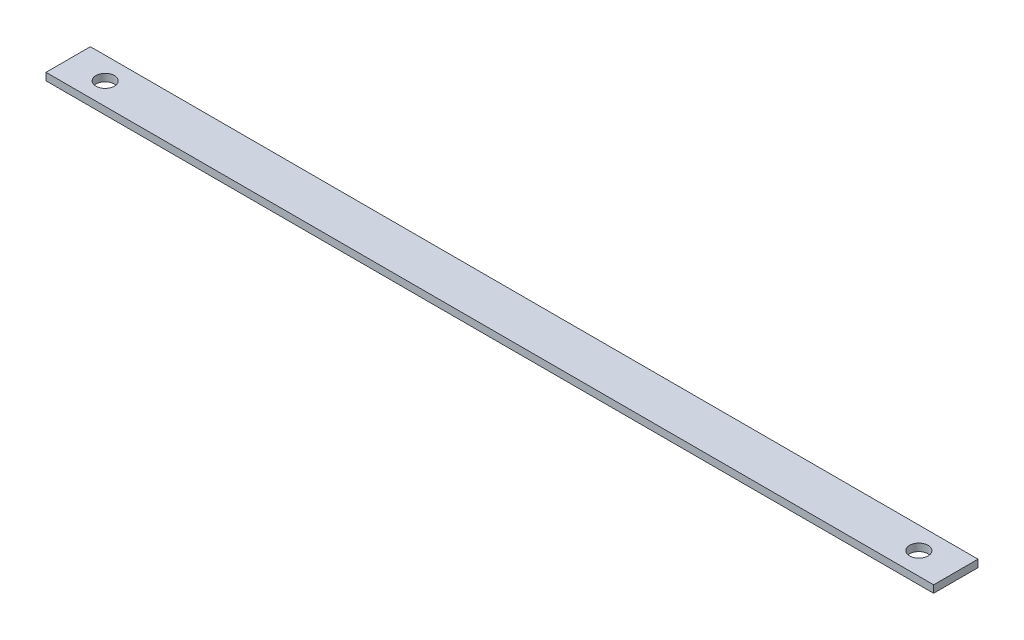
ISO-10303-21;
HEADER;
FILE_DESCRIPTION(('STEP AP214'),'2;1');
FILE_NAME('part.step','',(''),(''),'','','');
FILE_SCHEMA(('AUTOMOTIVE_DESIGN { 1 0 10303 214 1 1 1 1 }'));
ENDSEC;
DATA;
#1=APPLICATION_CONTEXT('core data for automotive mechanical design processes');
#2=APPLICATION_PROTOCOL_DEFINITION('international standard','automotive_design',2000,#1);
#3=PRODUCT_CONTEXT('',#1,'mechanical');
#4=PRODUCT('Part','Part','',(#3));
#5=PRODUCT_RELATED_PRODUCT_CATEGORY('part','',(#4));
#6=PRODUCT_DEFINITION_FORMATION('','',#4);
#7=PRODUCT_DEFINITION_CONTEXT('part definition',#1,'design');
#8=PRODUCT_DEFINITION('design','',#6,#7);
#9=PRODUCT_DEFINITION_SHAPE('','',#8);
#10=(LENGTH_UNIT() NAMED_UNIT(*) SI_UNIT(.MILLI.,.METRE.));
#11=(NAMED_UNIT(*) PLANE_ANGLE_UNIT() SI_UNIT($,.RADIAN.));
#12=(NAMED_UNIT(*) SI_UNIT($,.STERADIAN.) SOLID_ANGLE_UNIT());
#13=UNCERTAINTY_MEASURE_WITH_UNIT(LENGTH_MEASURE(1.E-05),#10,'distance_accuracy_value','');
#14=(GEOMETRIC_REPRESENTATION_CONTEXT(3) GLOBAL_UNCERTAINTY_ASSIGNED_CONTEXT((#13)) GLOBAL_UNIT_ASSIGNED_CONTEXT((#10,
#11,#12)) REPRESENTATION_CONTEXT('',''));
#15=CARTESIAN_POINT('',(0.,0.,0.));
#16=DIRECTION('',(0.,0.,1.));
#17=DIRECTION('',(1.,0.,0.));
#18=AXIS2_PLACEMENT_3D('',#15,#16,#17);
#19=CARTESIAN_POINT('',(0.,2.,0.));
#20=DIRECTION('',(0.,-1.,0.));
#21=DIRECTION('',(0.,0.,-1.));
#22=AXIS2_PLACEMENT_3D('',#19,#20,#21);
#23=PLANE('',#22);
#24=DIRECTION('',(0.,0.,-1.));
#25=VECTOR('',#24,1.);
#26=CARTESIAN_POINT('',(120.,2.,6.));
#27=LINE('',#26,#25);
#28=CARTESIAN_POINT('',(120.,2.,6.));
#29=VERTEX_POINT('',#28);
#30=CARTESIAN_POINT('',(120.,2.,-6.));
#31=VERTEX_POINT('',#30);
#32=EDGE_CURVE('E87',#29,#31,#27,.T.);
#33=ORIENTED_EDGE('',*,*,#32,.T.);
#34=DIRECTION('',(-1.,0.,0.));
#35=VECTOR('',#34,1.);
#36=CARTESIAN_POINT('',(-120.,2.,-6.));
#37=LINE('',#36,#35);
#38=CARTESIAN_POINT('',(-120.,2.,-6.));
#39=VERTEX_POINT('',#38);
#40=EDGE_CURVE('E82',#31,#39,#37,.T.);
#41=ORIENTED_EDGE('',*,*,#40,.T.);
#42=DIRECTION('',(0.,0.,1.));
#43=VECTOR('',#42,1.);
#44=CARTESIAN_POINT('',(-120.,2.,6.));
#45=LINE('',#44,#43);
#46=CARTESIAN_POINT('',(-120.,2.,6.));
#47=VERTEX_POINT('',#46);
#48=EDGE_CURVE('E85',#39,#47,#45,.T.);
#49=ORIENTED_EDGE('',*,*,#48,.T.);
#50=DIRECTION('',(1.,0.,0.));
#51=VECTOR('',#50,1.);
#52=CARTESIAN_POINT('',(-120.,2.,6.));
#53=LINE('',#52,#51);
#54=EDGE_CURVE('E52',#47,#29,#53,.T.);
#55=ORIENTED_EDGE('',*,*,#54,.T.);
#56=EDGE_LOOP('',(#33,#41,#49,#55));
#57=FACE_BOUND('',#56,.T.);
#58=CARTESIAN_POINT('',(110.,2.,0.));
#59=DIRECTION('',(0.,1.,0.));
#60=DIRECTION('',(0.,0.,1.));
#61=AXIS2_PLACEMENT_3D('',#58,#59,#60);
#62=CIRCLE('',#61,2.5);
#63=CARTESIAN_POINT('',(110.,2.,2.5));
#64=VERTEX_POINT('',#63);
#65=EDGE_CURVE('E115',#64,#64,#62,.T.);
#66=ORIENTED_EDGE('',*,*,#65,.F.);
#67=EDGE_LOOP('',(#66));
#68=FACE_BOUND('',#67,.T.);
#69=CARTESIAN_POINT('',(-110.,2.,0.));
#70=DIRECTION('',(0.,1.,0.));
#71=DIRECTION('',(0.,0.,1.));
#72=AXIS2_PLACEMENT_3D('',#69,#70,#71);
#73=CIRCLE('',#72,2.5);
#74=CARTESIAN_POINT('',(-110.,2.,2.50000000000003));
#75=VERTEX_POINT('',#74);
#76=EDGE_CURVE('E121',#75,#75,#73,.T.);
#77=ORIENTED_EDGE('',*,*,#76,.F.);
#78=EDGE_LOOP('',(#77));
#79=FACE_BOUND('',#78,.T.);
#80=ADVANCED_FACE('F35',(#57,#68,#79),#23,.F.);
#81=CARTESIAN_POINT('',(120.,2.,6.));
#82=DIRECTION('',(-1.,0.,0.));
#83=DIRECTION('',(0.,0.,1.));
#84=AXIS2_PLACEMENT_3D('',#81,#82,#83);
#85=PLANE('',#84);
#86=DIRECTION('',(0.,0.,-1.));
#87=VECTOR('',#86,1.);
#88=CARTESIAN_POINT('',(120.,0.,6.));
#89=LINE('',#88,#87);
#90=CARTESIAN_POINT('',(120.,0.,6.));
#91=VERTEX_POINT('',#90);
#92=CARTESIAN_POINT('',(120.,0.,-6.));
#93=VERTEX_POINT('',#92);
#94=EDGE_CURVE('E99',#91,#93,#89,.T.);
#95=ORIENTED_EDGE('',*,*,#94,.T.);
#96=DIRECTION('',(0.,-1.,0.));
#97=VECTOR('',#96,1.);
#98=CARTESIAN_POINT('',(120.,2.,-6.));
#99=LINE('',#98,#97);
#100=EDGE_CURVE('E11',#31,#93,#99,.T.);
#101=ORIENTED_EDGE('',*,*,#100,.F.);
#102=ORIENTED_EDGE('',*,*,#32,.F.);
#103=DIRECTION('',(0.,-1.,0.));
#104=VECTOR('',#103,1.);
#105=CARTESIAN_POINT('',(120.,2.,6.));
#106=LINE('',#105,#104);
#107=EDGE_CURVE('E95',#29,#91,#106,.T.);
#108=ORIENTED_EDGE('',*,*,#107,.T.);
#109=EDGE_LOOP('',(#95,#101,#102,#108));
#110=FACE_BOUND('',#109,.T.);
#111=ADVANCED_FACE('F37',(#110),#85,.F.);
#112=CARTESIAN_POINT('',(-120.,2.,-6.));
#113=DIRECTION('',(0.,0.,1.));
#114=DIRECTION('',(1.,0.,0.));
#115=AXIS2_PLACEMENT_3D('',#112,#113,#114);
#116=PLANE('',#115);
#117=DIRECTION('',(-1.,0.,0.));
#118=VECTOR('',#117,1.);
#119=CARTESIAN_POINT('',(-120.,0.,-6.));
#120=LINE('',#119,#118);
#121=CARTESIAN_POINT('',(-120.,0.,-6.));
#122=VERTEX_POINT('',#121);
#123=EDGE_CURVE('E91',#93,#122,#120,.T.);
#124=ORIENTED_EDGE('',*,*,#123,.T.);
#125=DIRECTION('',(0.,-1.,0.));
#126=VECTOR('',#125,1.);
#127=CARTESIAN_POINT('',(-120.,2.,-6.));
#128=LINE('',#127,#126);
#129=EDGE_CURVE('E44',#39,#122,#128,.T.);
#130=ORIENTED_EDGE('',*,*,#129,.F.);
#131=ORIENTED_EDGE('',*,*,#40,.F.);
#132=ORIENTED_EDGE('',*,*,#100,.T.);
#133=EDGE_LOOP('',(#124,#130,#131,#132));
#134=FACE_BOUND('',#133,.T.);
#135=ADVANCED_FACE('F90',(#134),#116,.F.);
#136=CARTESIAN_POINT('',(-120.,2.,6.));
#137=DIRECTION('',(1.,0.,0.));
#138=DIRECTION('',(0.,0.,-1.));
#139=AXIS2_PLACEMENT_3D('',#136,#137,#138);
#140=PLANE('',#139);
#141=DIRECTION('',(0.,0.,1.));
#142=VECTOR('',#141,1.);
#143=CARTESIAN_POINT('',(-120.,0.,6.));
#144=LINE('',#143,#142);
#145=CARTESIAN_POINT('',(-120.,0.,6.));
#146=VERTEX_POINT('',#145);
#147=EDGE_CURVE('E69',#122,#146,#144,.T.);
#148=ORIENTED_EDGE('',*,*,#147,.T.);
#149=DIRECTION('',(0.,-1.,0.));
#150=VECTOR('',#149,1.);
#151=CARTESIAN_POINT('',(-120.,2.,6.));
#152=LINE('',#151,#150);
#153=EDGE_CURVE('E92',#47,#146,#152,.T.);
#154=ORIENTED_EDGE('',*,*,#153,.F.);
#155=ORIENTED_EDGE('',*,*,#48,.F.);
#156=ORIENTED_EDGE('',*,*,#129,.T.);
#157=EDGE_LOOP('',(#148,#154,#155,#156));
#158=FACE_BOUND('',#157,.T.);
#159=ADVANCED_FACE('F93',(#158),#140,.F.);
#160=CARTESIAN_POINT('',(-120.,2.,6.));
#161=DIRECTION('',(0.,0.,-1.));
#162=DIRECTION('',(-1.,0.,0.));
#163=AXIS2_PLACEMENT_3D('',#160,#161,#162);
#164=PLANE('',#163);
#165=DIRECTION('',(1.,0.,0.));
#166=VECTOR('',#165,1.);
#167=CARTESIAN_POINT('',(-120.,0.,6.));
#168=LINE('',#167,#166);
#169=EDGE_CURVE('E75',#146,#91,#168,.T.);
#170=ORIENTED_EDGE('',*,*,#169,.T.);
#171=ORIENTED_EDGE('',*,*,#107,.F.);
#172=ORIENTED_EDGE('',*,*,#54,.F.);
#173=ORIENTED_EDGE('',*,*,#153,.T.);
#174=EDGE_LOOP('',(#170,#171,#172,#173));
#175=FACE_BOUND('',#174,.T.);
#176=ADVANCED_FACE('F107',(#175),#164,.F.);
#177=CARTESIAN_POINT('',(0.,0.,0.));
#178=DIRECTION('',(0.,-1.,0.));
#179=DIRECTION('',(0.,0.,-1.));
#180=AXIS2_PLACEMENT_3D('',#177,#178,#179);
#181=PLANE('',#180);
#182=CARTESIAN_POINT('',(-110.,0.,0.));
#183=DIRECTION('',(0.,-1.,0.));
#184=DIRECTION('',(0.,0.,-1.));
#185=AXIS2_PLACEMENT_3D('',#182,#183,#184);
#186=CIRCLE('',#185,2.5);
#187=CARTESIAN_POINT('',(-110.,0.,-2.49999999999998));
#188=VERTEX_POINT('',#187);
#189=EDGE_CURVE('E118',#188,#188,#186,.T.);
#190=ORIENTED_EDGE('',*,*,#189,.F.);
#191=EDGE_LOOP('',(#190));
#192=FACE_BOUND('',#191,.T.);
#193=CARTESIAN_POINT('',(110.,0.,0.));
#194=DIRECTION('',(0.,-1.,0.));
#195=DIRECTION('',(0.,0.,-1.));
#196=AXIS2_PLACEMENT_3D('',#193,#194,#195);
#197=CIRCLE('',#196,2.5);
#198=CARTESIAN_POINT('',(110.,0.,-2.5));
#199=VERTEX_POINT('',#198);
#200=EDGE_CURVE('E102',#199,#199,#197,.T.);
#201=ORIENTED_EDGE('',*,*,#200,.F.);
#202=EDGE_LOOP('',(#201));
#203=FACE_BOUND('',#202,.T.);
#204=ORIENTED_EDGE('',*,*,#94,.F.);
#205=ORIENTED_EDGE('',*,*,#169,.F.);
#206=ORIENTED_EDGE('',*,*,#147,.F.);
#207=ORIENTED_EDGE('',*,*,#123,.F.);
#208=EDGE_LOOP('',(#204,#205,#206,#207));
#209=FACE_BOUND('',#208,.T.);
#210=ADVANCED_FACE('F110',(#192,#203,#209),#181,.T.);
#211=CARTESIAN_POINT('',(110.,2.,0.));
#212=DIRECTION('',(0.,1.,0.));
#213=DIRECTION('',(0.,0.,1.));
#214=AXIS2_PLACEMENT_3D('',#211,#212,#213);
#215=CYLINDRICAL_SURFACE('',#214,2.5);
#216=ORIENTED_EDGE('',*,*,#65,.T.);
#217=EDGE_LOOP('',(#216));
#218=FACE_BOUND('',#217,.T.);
#219=ORIENTED_EDGE('',*,*,#200,.T.);
#220=EDGE_LOOP('',(#219));
#221=FACE_BOUND('',#220,.T.);
#222=ADVANCED_FACE('F135',(#218,#221),#215,.F.);
#223=CARTESIAN_POINT('',(-110.,2.,0.));
#224=DIRECTION('',(0.,1.,0.));
#225=DIRECTION('',(0.,0.,1.));
#226=AXIS2_PLACEMENT_3D('',#223,#224,#225);
#227=CYLINDRICAL_SURFACE('',#226,2.5);
#228=ORIENTED_EDGE('',*,*,#76,.T.);
#229=EDGE_LOOP('',(#228));
#230=FACE_BOUND('',#229,.T.);
#231=ORIENTED_EDGE('',*,*,#189,.T.);
#232=EDGE_LOOP('',(#231));
#233=FACE_BOUND('',#232,.T.);
#234=ADVANCED_FACE('F125',(#230,#233),#227,.F.);
#235=CLOSED_SHELL('',(#80,#111,#135,#159,#176,#210,#222,#234));
#236=MANIFOLD_SOLID_BREP('B2',#235);
#237=ADVANCED_BREP_SHAPE_REPRESENTATION('',(#18,#236),#14);
#238=SHAPE_DEFINITION_REPRESENTATION(#9,#237);
ENDSEC;
END-ISO-10303-21;
